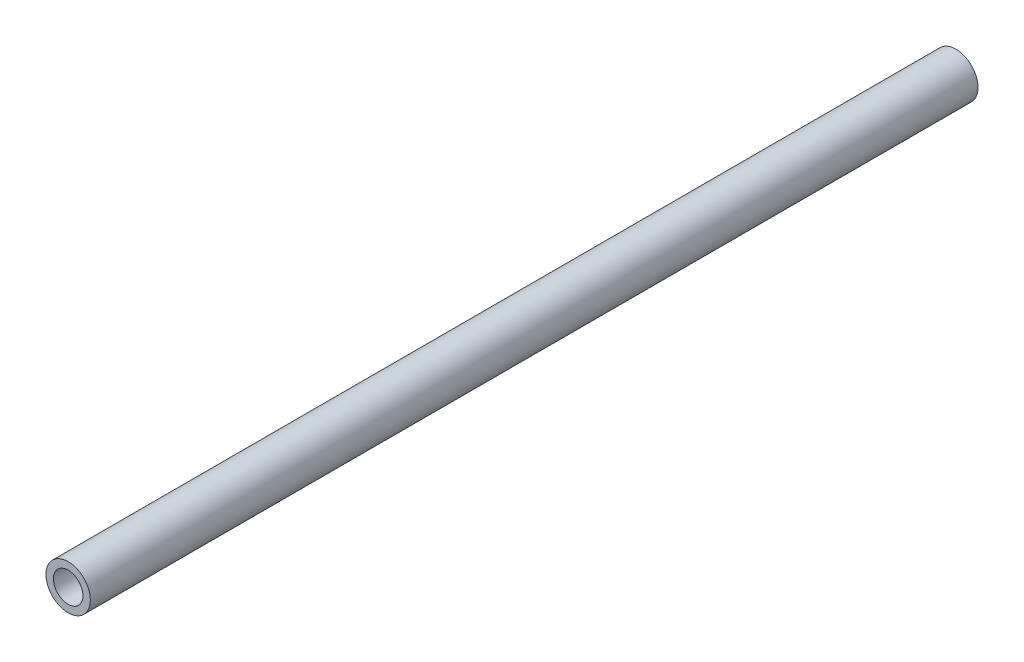
ISO-10303-21;
HEADER;
FILE_DESCRIPTION(('STEP AP214'),'2;1');
FILE_NAME('part.step','',(''),(''),'','','');
FILE_SCHEMA(('AUTOMOTIVE_DESIGN { 1 0 10303 214 1 1 1 1 }'));
ENDSEC;
DATA;
#1=APPLICATION_CONTEXT('core data for automotive mechanical design processes');
#2=APPLICATION_PROTOCOL_DEFINITION('international standard','automotive_design',2000,#1);
#3=PRODUCT_CONTEXT('',#1,'mechanical');
#4=PRODUCT('Part','Part','',(#3));
#5=PRODUCT_RELATED_PRODUCT_CATEGORY('part','',(#4));
#6=PRODUCT_DEFINITION_FORMATION('','',#4);
#7=PRODUCT_DEFINITION_CONTEXT('part definition',#1,'design');
#8=PRODUCT_DEFINITION('design','',#6,#7);
#9=PRODUCT_DEFINITION_SHAPE('','',#8);
#10=(LENGTH_UNIT() NAMED_UNIT(*) SI_UNIT(.MILLI.,.METRE.));
#11=(NAMED_UNIT(*) PLANE_ANGLE_UNIT() SI_UNIT($,.RADIAN.));
#12=(NAMED_UNIT(*) SI_UNIT($,.STERADIAN.) SOLID_ANGLE_UNIT());
#13=UNCERTAINTY_MEASURE_WITH_UNIT(LENGTH_MEASURE(1.E-05),#10,'distance_accuracy_value','');
#14=(GEOMETRIC_REPRESENTATION_CONTEXT(3) GLOBAL_UNCERTAINTY_ASSIGNED_CONTEXT((#13)) GLOBAL_UNIT_ASSIGNED_CONTEXT((#10,
#11,#12)) REPRESENTATION_CONTEXT('',''));
#15=CARTESIAN_POINT('',(0.,0.,0.));
#16=DIRECTION('',(0.,0.,1.));
#17=DIRECTION('',(1.,0.,0.));
#18=AXIS2_PLACEMENT_3D('',#15,#16,#17);
#19=CARTESIAN_POINT('',(0.,0.,120.));
#20=DIRECTION('',(0.,0.,1.));
#21=DIRECTION('',(1.,0.,0.));
#22=AXIS2_PLACEMENT_3D('',#19,#20,#21);
#23=PLANE('',#22);
#24=CARTESIAN_POINT('',(0.,0.,120.));
#25=DIRECTION('',(0.,0.,1.));
#26=DIRECTION('',(1.,0.,0.));
#27=AXIS2_PLACEMENT_3D('',#24,#25,#26);
#28=CIRCLE('',#27,3.);
#29=CARTESIAN_POINT('',(3.,0.,120.));
#30=VERTEX_POINT('',#29);
#31=EDGE_CURVE('E10',#30,#30,#28,.T.);
#32=ORIENTED_EDGE('',*,*,#31,.T.);
#33=EDGE_LOOP('',(#32));
#34=FACE_BOUND('',#33,.T.);
#35=CARTESIAN_POINT('',(0.,0.,120.));
#36=DIRECTION('',(0.,0.,1.));
#37=DIRECTION('',(1.,0.,0.));
#38=AXIS2_PLACEMENT_3D('',#35,#36,#37);
#39=CIRCLE('',#38,2.);
#40=CARTESIAN_POINT('',(2.,0.,120.));
#41=VERTEX_POINT('',#40);
#42=EDGE_CURVE('E50',#41,#41,#39,.T.);
#43=ORIENTED_EDGE('',*,*,#42,.F.);
#44=EDGE_LOOP('',(#43));
#45=FACE_BOUND('',#44,.T.);
#46=ADVANCED_FACE('F37',(#34,#45),#23,.T.);
#47=CARTESIAN_POINT('',(0.,0.,0.));
#48=DIRECTION('',(0.,0.,1.));
#49=DIRECTION('',(1.,0.,0.));
#50=AXIS2_PLACEMENT_3D('',#47,#48,#49);
#51=PLANE('',#50);
#52=CARTESIAN_POINT('',(0.,0.,0.));
#53=DIRECTION('',(0.,0.,1.));
#54=DIRECTION('',(1.,0.,0.));
#55=AXIS2_PLACEMENT_3D('',#52,#53,#54);
#56=CIRCLE('',#55,3.);
#57=CARTESIAN_POINT('',(3.,0.,0.));
#58=VERTEX_POINT('',#57);
#59=EDGE_CURVE('E41',#58,#58,#56,.T.);
#60=ORIENTED_EDGE('',*,*,#59,.F.);
#61=EDGE_LOOP('',(#60));
#62=FACE_BOUND('',#61,.T.);
#63=CARTESIAN_POINT('',(0.,0.,0.));
#64=DIRECTION('',(0.,0.,1.));
#65=DIRECTION('',(1.,0.,0.));
#66=AXIS2_PLACEMENT_3D('',#63,#64,#65);
#67=CIRCLE('',#66,2.);
#68=CARTESIAN_POINT('',(2.,0.,0.));
#69=VERTEX_POINT('',#68);
#70=EDGE_CURVE('E52',#69,#69,#67,.T.);
#71=ORIENTED_EDGE('',*,*,#70,.T.);
#72=EDGE_LOOP('',(#71));
#73=FACE_BOUND('',#72,.T.);
#74=ADVANCED_FACE('F64',(#62,#73),#51,.F.);
#75=CARTESIAN_POINT('',(0.,0.,120.));
#76=DIRECTION('',(0.,0.,-1.));
#77=DIRECTION('',(-1.,0.,0.));
#78=AXIS2_PLACEMENT_3D('',#75,#76,#77);
#79=CYLINDRICAL_SURFACE('',#78,3.);
#80=ORIENTED_EDGE('',*,*,#31,.F.);
#81=EDGE_LOOP('',(#80));
#82=FACE_BOUND('',#81,.T.);
#83=ORIENTED_EDGE('',*,*,#59,.T.);
#84=EDGE_LOOP('',(#83));
#85=FACE_BOUND('',#84,.T.);
#86=ADVANCED_FACE('F39',(#82,#85),#79,.T.);
#87=CARTESIAN_POINT('',(0.,0.,120.));
#88=DIRECTION('',(0.,0.,-1.));
#89=DIRECTION('',(-1.,0.,0.));
#90=AXIS2_PLACEMENT_3D('',#87,#88,#89);
#91=CYLINDRICAL_SURFACE('',#90,2.);
#92=ORIENTED_EDGE('',*,*,#42,.T.);
#93=EDGE_LOOP('',(#92));
#94=FACE_BOUND('',#93,.T.);
#95=ORIENTED_EDGE('',*,*,#70,.F.);
#96=EDGE_LOOP('',(#95));
#97=FACE_BOUND('',#96,.T.);
#98=ADVANCED_FACE('F60',(#94,#97),#91,.F.);
#99=CLOSED_SHELL('',(#46,#74,#86,#98));
#100=MANIFOLD_SOLID_BREP('B2',#99);
#101=ADVANCED_BREP_SHAPE_REPRESENTATION('',(#18,#100),#14);
#102=SHAPE_DEFINITION_REPRESENTATION(#9,#101);
ENDSEC;
END-ISO-10303-21;
